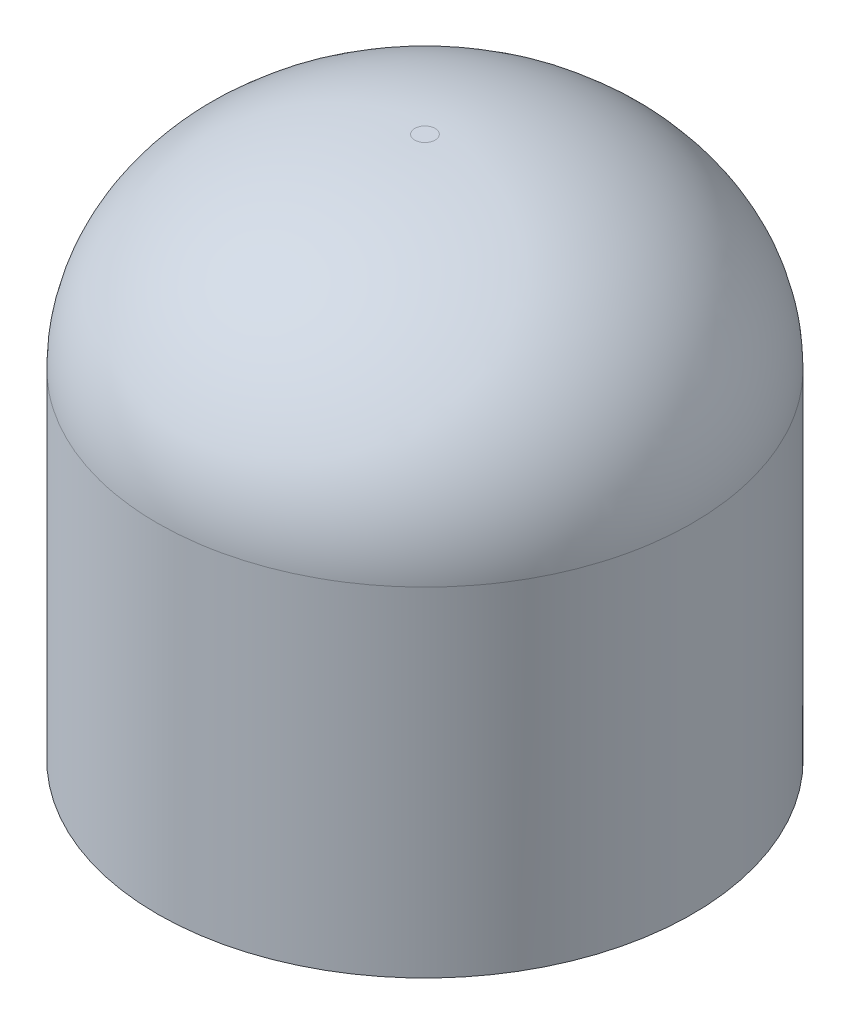
ISO-10303-21;
HEADER;
FILE_DESCRIPTION(('STEP AP214'),'2;1');
FILE_NAME('part.step','',(''),(''),'','','');
FILE_SCHEMA(('AUTOMOTIVE_DESIGN { 1 0 10303 214 1 1 1 1 }'));
ENDSEC;
DATA;
#1=APPLICATION_CONTEXT('core data for automotive mechanical design processes');
#2=APPLICATION_PROTOCOL_DEFINITION('international standard','automotive_design',2000,#1);
#3=PRODUCT_CONTEXT('',#1,'mechanical');
#4=PRODUCT('Part','Part','',(#3));
#5=PRODUCT_RELATED_PRODUCT_CATEGORY('part','',(#4));
#6=PRODUCT_DEFINITION_FORMATION('','',#4);
#7=PRODUCT_DEFINITION_CONTEXT('part definition',#1,'design');
#8=PRODUCT_DEFINITION('design','',#6,#7);
#9=PRODUCT_DEFINITION_SHAPE('','',#8);
#10=(LENGTH_UNIT() NAMED_UNIT(*) SI_UNIT(.MILLI.,.METRE.));
#11=(NAMED_UNIT(*) PLANE_ANGLE_UNIT() SI_UNIT($,.RADIAN.));
#12=(NAMED_UNIT(*) SI_UNIT($,.STERADIAN.) SOLID_ANGLE_UNIT());
#13=UNCERTAINTY_MEASURE_WITH_UNIT(LENGTH_MEASURE(1.E-05),#10,'distance_accuracy_value','');
#14=(GEOMETRIC_REPRESENTATION_CONTEXT(3) GLOBAL_UNCERTAINTY_ASSIGNED_CONTEXT((#13)) GLOBAL_UNIT_ASSIGNED_CONTEXT((#10,
#11,#12)) REPRESENTATION_CONTEXT('',''));
#15=CARTESIAN_POINT('',(0.,0.,0.));
#16=DIRECTION('',(0.,0.,1.));
#17=DIRECTION('',(1.,0.,0.));
#18=AXIS2_PLACEMENT_3D('',#15,#16,#17);
#19=CARTESIAN_POINT('',(0.,10.,0.));
#20=DIRECTION('',(0.,-1.,0.));
#21=DIRECTION('',(0.,0.,-1.));
#22=AXIS2_PLACEMENT_3D('',#19,#20,#21);
#23=CYLINDRICAL_SURFACE('',#22,19.75);
#24=CARTESIAN_POINT('',(0.,25.,19.75));
#25=CARTESIAN_POINT('',(2.58526818851115,25.,19.75));
#26=CARTESIAN_POINT('',(5.16952142379263,25.,19.2359600710616));
#27=CARTESIAN_POINT('',(9.94647415462842,25.,17.2572814631342));
#28=CARTESIAN_POINT('',(12.1372982611523,25.,15.7934195957163));
#29=CARTESIAN_POINT('',(15.7934195957163,25.,12.1372982611523));
#30=CARTESIAN_POINT('',(17.2572814631342,25.,9.94647415462842));
#31=CARTESIAN_POINT('',(19.2359600710616,25.,5.16952142379261));
#32=CARTESIAN_POINT('',(19.75,25.,2.58526818851105));
#33=CARTESIAN_POINT('',(19.75,25.,-2.58526818851105));
#34=CARTESIAN_POINT('',(19.2359600710616,25.,-5.16952142379261));
#35=CARTESIAN_POINT('',(17.2572814631342,25.,-9.94647415462845));
#36=CARTESIAN_POINT('',(15.7934195957164,25.,-12.1372982611523));
#37=CARTESIAN_POINT('',(12.1372982611523,25.,-15.7934195957164));
#38=CARTESIAN_POINT('',(9.94647415462843,25.,-17.2572814631342));
#39=CARTESIAN_POINT('',(5.16952142379267,25.,-19.2359600710616));
#40=CARTESIAN_POINT('',(2.58526818851105,25.,-19.75));
#41=CARTESIAN_POINT('',(-2.58526818851105,25.,-19.75));
#42=CARTESIAN_POINT('',(-5.1695214237926,25.,-19.2359600710616));
#43=CARTESIAN_POINT('',(-9.94647415462839,25.,-17.2572814631342));
#44=CARTESIAN_POINT('',(-12.1372982611523,25.,-15.7934195957164));
#45=CARTESIAN_POINT('',(-15.7934195957164,25.,-12.1372982611523));
#46=CARTESIAN_POINT('',(-17.2572814631342,25.,-9.94647415462852));
#47=CARTESIAN_POINT('',(-19.2359600710616,25.,-5.16952142379257));
#48=CARTESIAN_POINT('',(-19.75,25.,-2.58526818851102));
#49=CARTESIAN_POINT('',(-19.75,25.,2.58526818851109));
#50=CARTESIAN_POINT('',(-19.2359600710616,25.,5.16952142379256));
#51=CARTESIAN_POINT('',(-17.2572814631342,25.,9.94647415462842));
#52=CARTESIAN_POINT('',(-15.7934195957165,25.,12.1372982611521));
#53=CARTESIAN_POINT('',(-12.1372982611522,25.,15.7934195957164));
#54=CARTESIAN_POINT('',(-9.94647415462846,25.,17.2572814631342));
#55=CARTESIAN_POINT('',(-5.16952142379263,25.,19.2359600710616));
#56=CARTESIAN_POINT('',(-2.58526818851115,25.,19.75));
#57=CARTESIAN_POINT('',(0.,25.,19.75));
#58=(BOUNDED_CURVE() B_SPLINE_CURVE(3,(#24,#25,#26,#27,#28,#29,#30,#31,#32,#33,#34,#35,#36,#37,
#38,#39,#40,#41,#42,#43,#44,#45,#46,#47,#48,#49,#50,#51,#52,#53,#54,#55,#56,#57),.UNSPECIFIED.,
.T.,.F.) B_SPLINE_CURVE_WITH_KNOTS((4,2,2,2,2,2,2,2,2,2,2,2,2,2,2,2,4),(0.,0.392699081698724,
0.785398163397448,1.17809724509617,1.5707963267949,1.96349540849362,2.35619449019234,
2.74889357189107,3.14159265358979,3.53429173528852,3.92699081698724,4.31968989868597,
4.71238898038469,5.10508806208341,5.49778714378214,5.89048622548086,6.28318530717959),
.UNSPECIFIED.) CURVE() GEOMETRIC_REPRESENTATION_ITEM() RATIONAL_B_SPLINE_CURVE((1.,1.,1.,1.,1.,
1.,1.,1.,1.,1.,1.,1.,1.,1.,1.,1.,1.,1.,1.,1.,1.,1.,1.,1.,1.,1.,1.,1.,1.,1.,1.,1.,1.,1.)) REPRESENTATION_ITEM(''));
#59=CARTESIAN_POINT('',(0.,25.,19.75));
#60=VERTEX_POINT('',#59);
#61=EDGE_CURVE('E11',#60,#60,#58,.F.);
#62=ORIENTED_EDGE('',*,*,#61,.T.);
#63=EDGE_LOOP('',(#62));
#64=FACE_BOUND('',#63,.T.);
#65=CARTESIAN_POINT('',(0.,0.,0.));
#66=DIRECTION('',(0.,1.,0.));
#67=DIRECTION('',(0.,0.,1.));
#68=AXIS2_PLACEMENT_3D('',#65,#66,#67);
#69=CIRCLE('',#68,19.75);
#70=CARTESIAN_POINT('',(0.,0.,19.75));
#71=VERTEX_POINT('',#70);
#72=EDGE_CURVE('E54',#71,#71,#69,.T.);
#73=ORIENTED_EDGE('',*,*,#72,.T.);
#74=EDGE_LOOP('',(#73));
#75=FACE_BOUND('',#74,.T.);
#76=ADVANCED_FACE('F36',(#64,#75),#23,.T.);
#77=CARTESIAN_POINT('',(0.,0.,0.));
#78=DIRECTION('',(0.,1.,0.));
#79=DIRECTION('',(0.,0.,1.));
#80=AXIS2_PLACEMENT_3D('',#77,#78,#79);
#81=PLANE('',#80);
#82=CARTESIAN_POINT('',(0.,0.,0.));
#83=DIRECTION('',(0.,-1.,0.));
#84=DIRECTION('',(0.,0.,-1.));
#85=AXIS2_PLACEMENT_3D('',#82,#83,#84);
#86=CIRCLE('',#85,16.);
#87=CARTESIAN_POINT('',(0.,0.,-16.));
#88=VERTEX_POINT('',#87);
#89=EDGE_CURVE('E141',#88,#88,#86,.T.);
#90=ORIENTED_EDGE('',*,*,#89,.F.);
#91=EDGE_LOOP('',(#90));
#92=FACE_BOUND('',#91,.T.);
#93=ORIENTED_EDGE('',*,*,#72,.F.);
#94=EDGE_LOOP('',(#93));
#95=FACE_BOUND('',#94,.T.);
#96=ADVANCED_FACE('F82',(#92,#95),#81,.F.);
#97=CARTESIAN_POINT('',(0.,40.,0.));
#98=DIRECTION('',(0.,1.,0.));
#99=DIRECTION('',(0.,0.,1.));
#100=AXIS2_PLACEMENT_3D('',#97,#98,#99);
#101=PLANE('',#100);
#102=CARTESIAN_POINT('',(0.,40.,0.750000000000001));
#103=CARTESIAN_POINT('',(-0.0981747413358666,40.,0.750000000000001));
#104=CARTESIAN_POINT('',(-0.196310940144025,40.,0.730479496369426));
#105=CARTESIAN_POINT('',(-0.377714208403612,40.,0.655339802397504));
#106=CARTESIAN_POINT('',(-0.460910060550088,40.,0.599750111229734));
#107=CARTESIAN_POINT('',(-0.599750111229738,40.,0.460910060550085));
#108=CARTESIAN_POINT('',(-0.6553398023975,40.,0.377714208403612));
#109=CARTESIAN_POINT('',(-0.730479496369432,40.,0.196310940144021));
#110=CARTESIAN_POINT('',(-0.750000000000001,40.,0.0981747413358641));
#111=CARTESIAN_POINT('',(-0.750000000000001,40.,-0.0981747413358618));
#112=CARTESIAN_POINT('',(-0.730479496369426,40.,-0.196310940144025));
#113=CARTESIAN_POINT('',(-0.655339802397504,40.,-0.377714208403612));
#114=CARTESIAN_POINT('',(-0.599750111229731,40.,-0.46091006055008));
#115=CARTESIAN_POINT('',(-0.460910060550092,40.,-0.599750111229741));
#116=CARTESIAN_POINT('',(-0.377714208403612,40.,-0.655339802397505));
#117=CARTESIAN_POINT('',(-0.196310940144021,40.,-0.730479496369427));
#118=CARTESIAN_POINT('',(-0.0981747413358628,40.,-0.750000000000001));
#119=CARTESIAN_POINT('',(0.0981747413358629,40.,-0.750000000000001));
#120=CARTESIAN_POINT('',(0.196310940144028,40.,-0.730479496369426));
#121=CARTESIAN_POINT('',(0.377714208403609,40.,-0.655339802397504));
#122=CARTESIAN_POINT('',(0.460910060550086,40.,-0.599750111229737));
#123=CARTESIAN_POINT('',(0.599750111229736,40.,-0.460910060550087));
#124=CARTESIAN_POINT('',(0.6553398023975,40.,-0.377714208403612));
#125=CARTESIAN_POINT('',(0.730479496369431,40.,-0.196310940144024));
#126=CARTESIAN_POINT('',(0.750000000000001,40.,-0.0981747413358628));
#127=CARTESIAN_POINT('',(0.750000000000001,40.,0.0981747413358629));
#128=CARTESIAN_POINT('',(0.730479496369431,40.,0.196310940144023));
#129=CARTESIAN_POINT('',(0.655339802397501,40.,0.377714208403611));
#130=CARTESIAN_POINT('',(0.599750111229736,40.,0.460910060550087));
#131=CARTESIAN_POINT('',(0.460910060550087,40.,0.599750111229736));
#132=CARTESIAN_POINT('',(0.37771420840361,40.,0.655339802397504));
#133=CARTESIAN_POINT('',(0.196310940144025,40.,0.730479496369427));
#134=CARTESIAN_POINT('',(0.0981747413358665,40.,0.750000000000001));
#135=CARTESIAN_POINT('',(0.,40.,0.750000000000001));
#136=(BOUNDED_CURVE() B_SPLINE_CURVE(3,(#102,#103,#104,#105,#106,#107,#108,#109,#110,#111,#112,
#113,#114,#115,#116,#117,#118,#119,#120,#121,#122,#123,#124,#125,#126,#127,#128,#129,#130,#131,
#132,#133,#134,#135),.UNSPECIFIED.,.T.,.F.) B_SPLINE_CURVE_WITH_KNOTS((4,2,2,2,2,2,2,2,2,2,2,2,
2,2,2,2,4),(0.,0.392699081698725,0.785398163397448,1.17809724509617,1.5707963267949,
1.96349540849362,2.35619449019234,2.74889357189107,3.14159265358979,3.53429173528852,
3.92699081698724,4.31968989868597,4.71238898038469,5.10508806208341,5.49778714378214,
5.89048622548086,6.28318530717959),
.UNSPECIFIED.) CURVE() GEOMETRIC_REPRESENTATION_ITEM() RATIONAL_B_SPLINE_CURVE((1.,1.,1.,1.,1.,
1.,1.,1.,1.,1.,1.,1.,1.,1.,1.,1.,1.,1.,1.,1.,1.,1.,1.,1.,1.,1.,1.,1.,1.,1.,1.,1.,1.,1.)) REPRESENTATION_ITEM(''));
#137=CARTESIAN_POINT('',(0.,40.,0.750000000000001));
#138=VERTEX_POINT('',#137);
#139=EDGE_CURVE('E49',#138,#138,#136,.F.);
#140=ORIENTED_EDGE('',*,*,#139,.T.);
#141=EDGE_LOOP('',(#140));
#142=FACE_BOUND('',#141,.T.);
#143=ADVANCED_FACE('F72',(#142),#101,.T.);
#144=CARTESIAN_POINT('',(0.,40.,0.750000000000001));
#145=CARTESIAN_POINT('',(0.0981747413358665,40.,0.750000000000001));
#146=CARTESIAN_POINT('',(0.196310940144025,40.,0.730479496369427));
#147=CARTESIAN_POINT('',(0.37771420840361,40.,0.655339802397504));
#148=CARTESIAN_POINT('',(0.460910060550087,40.,0.599750111229736));
#149=CARTESIAN_POINT('',(0.599750111229736,40.,0.460910060550087));
#150=CARTESIAN_POINT('',(0.655339802397501,40.,0.377714208403611));
#151=CARTESIAN_POINT('',(0.730479496369431,40.,0.196310940144023));
#152=CARTESIAN_POINT('',(0.750000000000001,40.,0.0981747413358629));
#153=CARTESIAN_POINT('',(0.750000000000001,40.,-0.0981747413358628));
#154=CARTESIAN_POINT('',(0.730479496369431,40.,-0.196310940144024));
#155=CARTESIAN_POINT('',(0.6553398023975,40.,-0.377714208403612));
#156=CARTESIAN_POINT('',(0.599750111229736,40.,-0.460910060550087));
#157=CARTESIAN_POINT('',(0.460910060550086,40.,-0.599750111229737));
#158=CARTESIAN_POINT('',(0.377714208403609,40.,-0.655339802397504));
#159=CARTESIAN_POINT('',(0.196310940144028,40.,-0.730479496369426));
#160=CARTESIAN_POINT('',(0.0981747413358629,40.,-0.750000000000001));
#161=CARTESIAN_POINT('',(-0.0981747413358628,40.,-0.750000000000001));
#162=CARTESIAN_POINT('',(-0.196310940144021,40.,-0.730479496369427));
#163=CARTESIAN_POINT('',(-0.377714208403612,40.,-0.655339802397505));
#164=CARTESIAN_POINT('',(-0.460910060550092,40.,-0.599750111229741));
#165=CARTESIAN_POINT('',(-0.599750111229731,40.,-0.46091006055008));
#166=CARTESIAN_POINT('',(-0.655339802397504,40.,-0.377714208403612));
#167=CARTESIAN_POINT('',(-0.730479496369426,40.,-0.196310940144025));
#168=CARTESIAN_POINT('',(-0.750000000000001,40.,-0.0981747413358618));
#169=CARTESIAN_POINT('',(-0.750000000000001,40.,0.0981747413358641));
#170=CARTESIAN_POINT('',(-0.730479496369432,40.,0.196310940144021));
#171=CARTESIAN_POINT('',(-0.6553398023975,40.,0.377714208403612));
#172=CARTESIAN_POINT('',(-0.599750111229738,40.,0.460910060550085));
#173=CARTESIAN_POINT('',(-0.460910060550088,40.,0.599750111229734));
#174=CARTESIAN_POINT('',(-0.377714208403612,40.,0.655339802397504));
#175=CARTESIAN_POINT('',(-0.196310940144025,40.,0.730479496369426));
#176=CARTESIAN_POINT('',(-0.0981747413358666,40.,0.750000000000001));
#177=CARTESIAN_POINT('',(0.,40.,0.750000000000001));
#178=CARTESIAN_POINT('',(0.,40.,19.75));
#179=CARTESIAN_POINT('',(2.58526818851115,40.,19.7500000000005));
#180=CARTESIAN_POINT('',(5.16952142379255,40.0000000000003,19.2359600710615));
#181=CARTESIAN_POINT('',(9.9464741546285,39.9999999999997,17.2572814631343));
#182=CARTESIAN_POINT('',(12.1372982611525,40.,15.7934195957166));
#183=CARTESIAN_POINT('',(15.7934195957162,40.,12.137298261152));
#184=CARTESIAN_POINT('',(17.2572814631343,39.9999999999997,9.94647415462843));
#185=CARTESIAN_POINT('',(19.2359600710615,40.0000000000003,5.1695214237926));
#186=CARTESIAN_POINT('',(19.75,40.,2.58526818851105));
#187=CARTESIAN_POINT('',(19.75,40.,-2.58526818851105));
#188=CARTESIAN_POINT('',(19.2359600710617,40.,-5.16952142379257));
#189=CARTESIAN_POINT('',(17.2572814631341,40.,-9.94647415462849));
#190=CARTESIAN_POINT('',(15.7934195957164,40.,-12.1372982611522));
#191=CARTESIAN_POINT('',(12.1372982611522,40.,-15.7934195957164));
#192=CARTESIAN_POINT('',(9.9464741546284,40.,-17.257281463134));
#193=CARTESIAN_POINT('',(5.1695214237927,40.,-19.2359600710618));
#194=CARTESIAN_POINT('',(2.58526818851105,40.,-19.75));
#195=CARTESIAN_POINT('',(-2.58526818851105,40.,-19.75));
#196=CARTESIAN_POINT('',(-5.16952142379256,39.999999999999,-19.2359600710617));
#197=CARTESIAN_POINT('',(-9.94647415462843,40.000000000001,-17.2572814631342));
#198=CARTESIAN_POINT('',(-12.1372982611523,40.,-15.7934195957163));
#199=CARTESIAN_POINT('',(-15.7934195957163,40.,-12.1372982611523));
#200=CARTESIAN_POINT('',(-17.2572814631336,40.0000000000003,-9.94647415462836));
#201=CARTESIAN_POINT('',(-19.2359600710622,39.9999999999997,-5.16952142379274));
#202=CARTESIAN_POINT('',(-19.7500000000002,40.,-2.58526818851102));
#203=CARTESIAN_POINT('',(-19.7499999999998,40.,2.58526818851109));
#204=CARTESIAN_POINT('',(-19.2359600710613,40.,5.16952142379248));
#205=CARTESIAN_POINT('',(-17.2572814631345,40.,9.94647415462851));
#206=CARTESIAN_POINT('',(-15.7934195957164,40.0000000000003,12.1372982611521));
#207=CARTESIAN_POINT('',(-12.1372982611524,39.9999999999997,15.7934195957164));
#208=CARTESIAN_POINT('',(-9.94647415462844,39.9999999999997,17.2572814631343));
#209=CARTESIAN_POINT('',(-5.16952142379266,40.0000000000003,19.2359600710615));
#210=CARTESIAN_POINT('',(-2.58526818851115,40.,19.7499999999995));
#211=CARTESIAN_POINT('',(0.,40.,19.75));
#212=CARTESIAN_POINT('',(0.,25.,19.75));
#213=CARTESIAN_POINT('',(2.58526818851115,25.,19.75));
#214=CARTESIAN_POINT('',(5.16952142379263,25.,19.2359600710616));
#215=CARTESIAN_POINT('',(9.94647415462842,25.,17.2572814631342));
#216=CARTESIAN_POINT('',(12.1372982611523,25.,15.7934195957163));
#217=CARTESIAN_POINT('',(15.7934195957163,25.,12.1372982611523));
#218=CARTESIAN_POINT('',(17.2572814631342,25.,9.94647415462842));
#219=CARTESIAN_POINT('',(19.2359600710616,25.,5.16952142379261));
#220=CARTESIAN_POINT('',(19.75,25.,2.58526818851105));
#221=CARTESIAN_POINT('',(19.75,25.,-2.58526818851105));
#222=CARTESIAN_POINT('',(19.2359600710616,25.,-5.16952142379261));
#223=CARTESIAN_POINT('',(17.2572814631342,25.,-9.94647415462845));
#224=CARTESIAN_POINT('',(15.7934195957164,25.,-12.1372982611523));
#225=CARTESIAN_POINT('',(12.1372982611523,25.,-15.7934195957164));
#226=CARTESIAN_POINT('',(9.94647415462843,25.,-17.2572814631342));
#227=CARTESIAN_POINT('',(5.16952142379267,25.,-19.2359600710616));
#228=CARTESIAN_POINT('',(2.58526818851105,25.,-19.75));
#229=CARTESIAN_POINT('',(-2.58526818851105,25.,-19.75));
#230=CARTESIAN_POINT('',(-5.1695214237926,25.,-19.2359600710616));
#231=CARTESIAN_POINT('',(-9.94647415462839,25.,-17.2572814631342));
#232=CARTESIAN_POINT('',(-12.1372982611523,25.,-15.7934195957164));
#233=CARTESIAN_POINT('',(-15.7934195957164,25.,-12.1372982611523));
#234=CARTESIAN_POINT('',(-17.2572814631342,25.,-9.94647415462852));
#235=CARTESIAN_POINT('',(-19.2359600710616,25.,-5.16952142379257));
#236=CARTESIAN_POINT('',(-19.75,25.,-2.58526818851102));
#237=CARTESIAN_POINT('',(-19.75,25.,2.58526818851109));
#238=CARTESIAN_POINT('',(-19.2359600710616,25.,5.16952142379256));
#239=CARTESIAN_POINT('',(-17.2572814631342,25.,9.94647415462842));
#240=CARTESIAN_POINT('',(-15.7934195957165,25.,12.1372982611521));
#241=CARTESIAN_POINT('',(-12.1372982611522,25.,15.7934195957164));
#242=CARTESIAN_POINT('',(-9.94647415462846,25.,17.2572814631342));
#243=CARTESIAN_POINT('',(-5.16952142379263,25.,19.2359600710616));
#244=CARTESIAN_POINT('',(-2.58526818851115,25.,19.75));
#245=CARTESIAN_POINT('',(0.,25.,19.75));
#246=(BOUNDED_SURFACE() B_SPLINE_SURFACE(2,3,((#144,#145,#146,#147,#148,#149,#150,#151,#152,
#153,#154,#155,#156,#157,#158,#159,#160,#161,#162,#163,#164,#165,#166,#167,#168,#169,#170,#171,
#172,#173,#174,#175,#176,#177),(#178,#179,#180,#181,#182,#183,#184,#185,#186,#187,#188,#189,
#190,#191,#192,#193,#194,#195,#196,#197,#198,#199,#200,#201,#202,#203,#204,#205,#206,#207,#208,
#209,#210,#211),(#212,#213,#214,#215,#216,#217,#218,#219,#220,#221,#222,#223,#224,#225,#226,
#227,#228,#229,#230,#231,#232,#233,#234,#235,#236,#237,#238,#239,#240,#241,#242,#243,#244,
#245)),.UNSPECIFIED.,.F.,.T.,.F.) B_SPLINE_SURFACE_WITH_KNOTS((3,3),(4,2,2,2,2,2,2,2,2,2,2,2,2,
2,2,2,4),(0.,1.),(0.,0.392699081698724,0.785398163397448,1.17809724509617,1.5707963267949,
1.96349540849362,2.35619449019234,2.74889357189107,3.14159265358979,3.53429173528852,
3.92699081698724,4.31968989868597,4.71238898038469,5.10508806208341,5.49778714378214,
5.89048622548086,6.28318530717959),
.UNSPECIFIED.) GEOMETRIC_REPRESENTATION_ITEM() RATIONAL_B_SPLINE_SURFACE(((1.,1.,1.,1.,1.,1.,1.,
1.,1.,1.,1.,1.,1.,1.,1.,1.,1.,1.,1.,1.,1.,1.,1.,1.,1.,1.,1.,1.,1.,1.,1.,1.,1.,1.),
(0.707106781186547,0.707106781186547,0.707106781186547,0.707106781186547,0.707106781186547,
0.707106781186547,0.707106781186547,0.707106781186547,0.707106781186547,0.707106781186547,
0.707106781186547,0.707106781186547,0.707106781186547,0.707106781186547,0.707106781186547,
0.707106781186547,0.707106781186547,0.707106781186547,0.707106781186547,0.707106781186547,
0.707106781186547,0.707106781186547,0.707106781186547,0.707106781186547,0.707106781186547,
0.707106781186547,0.707106781186547,0.707106781186547,0.707106781186547,0.707106781186547,
0.707106781186547,0.707106781186547,0.707106781186547,0.707106781186547),(1.,1.,1.,1.,1.,1.,1.,
1.,1.,1.,1.,1.,1.,1.,1.,1.,1.,1.,1.,1.,1.,1.,1.,1.,1.,1.,1.,1.,1.,1.,1.,1.,1.,1.))) REPRESENTATION_ITEM('') SURFACE());
#247=ORIENTED_EDGE('',*,*,#61,.F.);
#248=EDGE_LOOP('',(#247));
#249=FACE_BOUND('',#248,.T.);
#250=ORIENTED_EDGE('',*,*,#139,.F.);
#251=EDGE_LOOP('',(#250));
#252=FACE_BOUND('',#251,.T.);
#253=ADVANCED_FACE('F39',(#249,#252),#246,.T.);
#254=CARTESIAN_POINT('',(0.,10.,0.));
#255=DIRECTION('',(0.,-1.,0.));
#256=DIRECTION('',(0.,0.,-1.));
#257=AXIS2_PLACEMENT_3D('',#254,#255,#256);
#258=CYLINDRICAL_SURFACE('',#257,16.);
#259=CARTESIAN_POINT('',(0.,10.,0.));
#260=DIRECTION('',(0.,-1.,0.));
#261=DIRECTION('',(0.,0.,-1.));
#262=AXIS2_PLACEMENT_3D('',#259,#260,#261);
#263=CIRCLE('',#262,16.);
#264=CARTESIAN_POINT('',(0.,10.,-16.));
#265=VERTEX_POINT('',#264);
#266=EDGE_CURVE('E139',#265,#265,#263,.T.);
#267=ORIENTED_EDGE('',*,*,#266,.F.);
#268=EDGE_LOOP('',(#267));
#269=FACE_BOUND('',#268,.T.);
#270=ORIENTED_EDGE('',*,*,#89,.T.);
#271=EDGE_LOOP('',(#270));
#272=FACE_BOUND('',#271,.T.);
#273=ADVANCED_FACE('F109',(#269,#272),#258,.F.);
#274=CARTESIAN_POINT('',(0.,10.,0.));
#275=DIRECTION('',(0.,-1.,0.));
#276=DIRECTION('',(0.,0.,-1.));
#277=AXIS2_PLACEMENT_3D('',#274,#275,#276);
#278=PLANE('',#277);
#279=CARTESIAN_POINT('',(0.,10.,0.));
#280=DIRECTION('',(0.,-1.,0.));
#281=DIRECTION('',(0.,0.,-1.));
#282=AXIS2_PLACEMENT_3D('',#279,#280,#281);
#283=CIRCLE('',#282,4.5);
#284=CARTESIAN_POINT('',(0.,10.,-4.5));
#285=VERTEX_POINT('',#284);
#286=EDGE_CURVE('E145',#285,#285,#283,.T.);
#287=ORIENTED_EDGE('',*,*,#286,.F.);
#288=EDGE_LOOP('',(#287));
#289=FACE_BOUND('',#288,.T.);
#290=ORIENTED_EDGE('',*,*,#266,.T.);
#291=EDGE_LOOP('',(#290));
#292=FACE_BOUND('',#291,.T.);
#293=ADVANCED_FACE('F113',(#289,#292),#278,.T.);
#294=CARTESIAN_POINT('',(0.,10.,0.));
#295=DIRECTION('',(0.,-1.,0.));
#296=DIRECTION('',(0.,0.,-1.));
#297=AXIS2_PLACEMENT_3D('',#294,#295,#296);
#298=CYLINDRICAL_SURFACE('',#297,4.5);
#299=ORIENTED_EDGE('',*,*,#286,.T.);
#300=EDGE_LOOP('',(#299));
#301=FACE_BOUND('',#300,.T.);
#302=CARTESIAN_POINT('',(0.,0.,0.));
#303=DIRECTION('',(0.,-1.,0.));
#304=DIRECTION('',(0.,0.,-1.));
#305=AXIS2_PLACEMENT_3D('',#302,#303,#304);
#306=CIRCLE('',#305,4.5);
#307=CARTESIAN_POINT('',(0.,0.,-4.5));
#308=VERTEX_POINT('',#307);
#309=EDGE_CURVE('E148',#308,#308,#306,.T.);
#310=ORIENTED_EDGE('',*,*,#309,.F.);
#311=EDGE_LOOP('',(#310));
#312=FACE_BOUND('',#311,.T.);
#313=ADVANCED_FACE('F119',(#301,#312),#298,.T.);
#314=CARTESIAN_POINT('',(0.,10.,0.));
#315=DIRECTION('',(0.,-1.,0.));
#316=DIRECTION('',(0.,0.,-1.));
#317=AXIS2_PLACEMENT_3D('',#314,#315,#316);
#318=PLANE('',#317);
#319=CARTESIAN_POINT('',(0.,10.,0.));
#320=DIRECTION('',(0.,-1.,0.));
#321=DIRECTION('',(0.,0.,-1.));
#322=AXIS2_PLACEMENT_3D('',#319,#320,#321);
#323=CIRCLE('',#322,2.5);
#324=CARTESIAN_POINT('',(0.,10.,-2.5));
#325=VERTEX_POINT('',#324);
#326=EDGE_CURVE('E59',#325,#325,#323,.T.);
#327=ORIENTED_EDGE('',*,*,#326,.T.);
#328=EDGE_LOOP('',(#327));
#329=FACE_BOUND('',#328,.T.);
#330=ADVANCED_FACE('F125',(#329),#318,.T.);
#331=CARTESIAN_POINT('',(0.,10.,0.));
#332=DIRECTION('',(0.,-1.,0.));
#333=DIRECTION('',(0.,0.,-1.));
#334=AXIS2_PLACEMENT_3D('',#331,#332,#333);
#335=CYLINDRICAL_SURFACE('',#334,2.5);
#336=ORIENTED_EDGE('',*,*,#326,.F.);
#337=EDGE_LOOP('',(#336));
#338=FACE_BOUND('',#337,.T.);
#339=CARTESIAN_POINT('',(0.,0.,0.));
#340=DIRECTION('',(0.,-1.,0.));
#341=DIRECTION('',(0.,0.,-1.));
#342=AXIS2_PLACEMENT_3D('',#339,#340,#341);
#343=CIRCLE('',#342,2.5);
#344=CARTESIAN_POINT('',(0.,0.,-2.5));
#345=VERTEX_POINT('',#344);
#346=EDGE_CURVE('E64',#345,#345,#343,.T.);
#347=ORIENTED_EDGE('',*,*,#346,.T.);
#348=EDGE_LOOP('',(#347));
#349=FACE_BOUND('',#348,.T.);
#350=ADVANCED_FACE('F83',(#338,#349),#335,.F.);
#351=ORIENTED_EDGE('',*,*,#346,.F.);
#352=EDGE_LOOP('',(#351));
#353=FACE_BOUND('',#352,.T.);
#354=ORIENTED_EDGE('',*,*,#309,.T.);
#355=EDGE_LOOP('',(#354));
#356=FACE_BOUND('',#355,.T.);
#357=ADVANCED_FACE('F87',(#353,#356),#81,.F.);
#358=CLOSED_SHELL('',(#76,#96,#143,#253,#273,#293,#313,#330,#350,#357));
#359=MANIFOLD_SOLID_BREP('B2',#358);
#360=ADVANCED_BREP_SHAPE_REPRESENTATION('',(#18,#359),#14);
#361=SHAPE_DEFINITION_REPRESENTATION(#9,#360);
ENDSEC;
END-ISO-10303-21;
